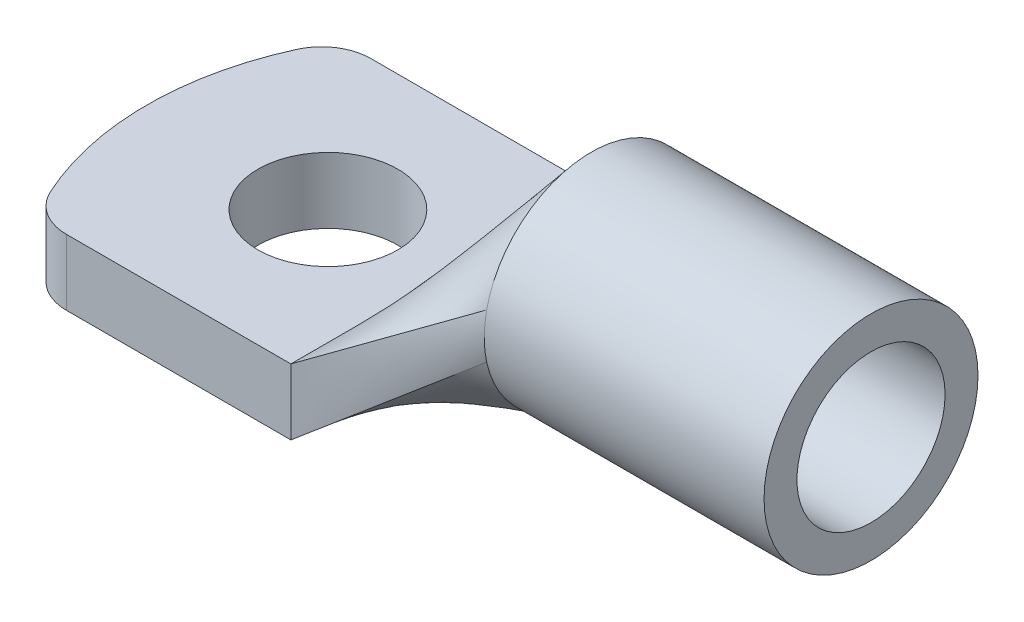
ISO-10303-21;
HEADER;
FILE_DESCRIPTION(('STEP AP214'),'2;1');
FILE_NAME('part.step','',(''),(''),'','','');
FILE_SCHEMA(('AUTOMOTIVE_DESIGN { 1 0 10303 214 1 1 1 1 }'));
ENDSEC;
DATA;
#1=APPLICATION_CONTEXT('core data for automotive mechanical design processes');
#2=APPLICATION_PROTOCOL_DEFINITION('international standard','automotive_design',2000,#1);
#3=PRODUCT_CONTEXT('',#1,'mechanical');
#4=PRODUCT('Part','Part','',(#3));
#5=PRODUCT_RELATED_PRODUCT_CATEGORY('part','',(#4));
#6=PRODUCT_DEFINITION_FORMATION('','',#4);
#7=PRODUCT_DEFINITION_CONTEXT('part definition',#1,'design');
#8=PRODUCT_DEFINITION('design','',#6,#7);
#9=PRODUCT_DEFINITION_SHAPE('','',#8);
#10=(LENGTH_UNIT() NAMED_UNIT(*) SI_UNIT(.MILLI.,.METRE.));
#11=(NAMED_UNIT(*) PLANE_ANGLE_UNIT() SI_UNIT($,.RADIAN.));
#12=(NAMED_UNIT(*) SI_UNIT($,.STERADIAN.) SOLID_ANGLE_UNIT());
#13=UNCERTAINTY_MEASURE_WITH_UNIT(LENGTH_MEASURE(1.E-05),#10,'distance_accuracy_value','');
#14=(GEOMETRIC_REPRESENTATION_CONTEXT(3) GLOBAL_UNCERTAINTY_ASSIGNED_CONTEXT((#13)) GLOBAL_UNIT_ASSIGNED_CONTEXT((#10,
#11,#12)) REPRESENTATION_CONTEXT('',''));
#15=CARTESIAN_POINT('',(0.,0.,0.));
#16=DIRECTION('',(0.,0.,1.));
#17=DIRECTION('',(1.,0.,0.));
#18=AXIS2_PLACEMENT_3D('',#15,#16,#17);
#19=CARTESIAN_POINT('',(0.,4.,-9.25));
#20=DIRECTION('',(0.,0.,-1.));
#21=DIRECTION('',(-1.,0.,0.));
#22=AXIS2_PLACEMENT_3D('',#19,#20,#21);
#23=PLANE('',#22);
#24=DIRECTION('',(1.,0.,0.));
#25=VECTOR('',#24,1.);
#26=CARTESIAN_POINT('',(0.,0.,-9.25));
#27=LINE('',#26,#25);
#28=CARTESIAN_POINT('',(-4.63589014329465,0.,-9.25));
#29=VERTEX_POINT('',#28);
#30=CARTESIAN_POINT('',(9.,0.,-9.25));
#31=VERTEX_POINT('',#30);
#32=EDGE_CURVE('E172',#29,#31,#27,.T.);
#33=ORIENTED_EDGE('',*,*,#32,.F.);
#34=DIRECTION('',(0.,1.,0.));
#35=VECTOR('',#34,1.);
#36=CARTESIAN_POINT('',(-4.63589014329465,4.,-9.25));
#37=LINE('',#36,#35);
#38=CARTESIAN_POINT('',(-4.63589014329465,4.,-9.25));
#39=VERTEX_POINT('',#38);
#40=EDGE_CURVE('E334',#29,#39,#37,.T.);
#41=ORIENTED_EDGE('',*,*,#40,.T.);
#42=DIRECTION('',(1.,0.,0.));
#43=VECTOR('',#42,1.);
#44=CARTESIAN_POINT('',(0.,4.,-9.25));
#45=LINE('',#44,#43);
#46=CARTESIAN_POINT('',(9.,4.,-9.25));
#47=VERTEX_POINT('',#46);
#48=EDGE_CURVE('E179',#39,#47,#45,.T.);
#49=ORIENTED_EDGE('',*,*,#48,.T.);
#50=DIRECTION('',(0.,1.,0.));
#51=VECTOR('',#50,1.);
#52=CARTESIAN_POINT('',(9.,4.,-9.25));
#53=LINE('',#52,#51);
#54=EDGE_CURVE('E185',#47,#31,#53,.F.);
#55=ORIENTED_EDGE('',*,*,#54,.T.);
#56=EDGE_LOOP('',(#33,#41,#49,#55));
#57=FACE_BOUND('',#56,.T.);
#58=ADVANCED_FACE('F74',(#57),#23,.T.);
#59=CARTESIAN_POINT('',(9.,4.,0.));
#60=DIRECTION('',(0.,-1.,0.));
#61=DIRECTION('',(0.,0.,-1.));
#62=AXIS2_PLACEMENT_3D('',#59,#60,#61);
#63=CYLINDRICAL_SURFACE('',#62,18.);
#64=CARTESIAN_POINT('',(9.,4.,0.));
#65=DIRECTION('',(0.,1.,0.));
#66=DIRECTION('',(0.,0.,1.));
#67=AXIS2_PLACEMENT_3D('',#64,#65,#66);
#68=CIRCLE('',#67,18.);
#69=CARTESIAN_POINT('',(-7.36306817195357,4.,-7.5));
#70=VERTEX_POINT('',#69);
#71=CARTESIAN_POINT('',(-7.36306817195357,4.,7.5));
#72=VERTEX_POINT('',#71);
#73=EDGE_CURVE('E178',#70,#72,#68,.T.);
#74=ORIENTED_EDGE('',*,*,#73,.F.);
#75=DIRECTION('',(0.,-1.,0.));
#76=VECTOR('',#75,1.);
#77=CARTESIAN_POINT('',(-7.36306817195358,4.,-7.5));
#78=LINE('',#77,#76);
#79=CARTESIAN_POINT('',(-7.36306817195357,0.,-7.5));
#80=VERTEX_POINT('',#79);
#81=EDGE_CURVE('E157',#70,#80,#78,.T.);
#82=ORIENTED_EDGE('',*,*,#81,.T.);
#83=CARTESIAN_POINT('',(9.,0.,0.));
#84=DIRECTION('',(0.,1.,0.));
#85=DIRECTION('',(0.,0.,1.));
#86=AXIS2_PLACEMENT_3D('',#83,#84,#85);
#87=CIRCLE('',#86,18.);
#88=CARTESIAN_POINT('',(-7.36306817195357,0.,7.5));
#89=VERTEX_POINT('',#88);
#90=EDGE_CURVE('E168',#80,#89,#87,.T.);
#91=ORIENTED_EDGE('',*,*,#90,.T.);
#92=DIRECTION('',(0.,-1.,0.));
#93=VECTOR('',#92,1.);
#94=CARTESIAN_POINT('',(-7.36306817195358,4.,7.5));
#95=LINE('',#94,#93);
#96=EDGE_CURVE('E153',#89,#72,#95,.F.);
#97=ORIENTED_EDGE('',*,*,#96,.T.);
#98=EDGE_LOOP('',(#74,#82,#91,#97));
#99=FACE_BOUND('',#98,.T.);
#100=ADVANCED_FACE('F343',(#99),#63,.T.);
#101=CARTESIAN_POINT('',(0.,4.,9.25));
#102=DIRECTION('',(0.,0.,-1.));
#103=DIRECTION('',(-1.,0.,0.));
#104=AXIS2_PLACEMENT_3D('',#101,#102,#103);
#105=PLANE('',#104);
#106=DIRECTION('',(1.,0.,0.));
#107=VECTOR('',#106,1.);
#108=CARTESIAN_POINT('',(0.,4.,9.25));
#109=LINE('',#108,#107);
#110=CARTESIAN_POINT('',(-4.63589014329465,4.,9.25));
#111=VERTEX_POINT('',#110);
#112=CARTESIAN_POINT('',(9.,4.,9.25));
#113=VERTEX_POINT('',#112);
#114=EDGE_CURVE('E164',#111,#113,#109,.T.);
#115=ORIENTED_EDGE('',*,*,#114,.F.);
#116=DIRECTION('',(0.,-1.,0.));
#117=VECTOR('',#116,1.);
#118=CARTESIAN_POINT('',(-4.63589014329465,4.,9.25));
#119=LINE('',#118,#117);
#120=CARTESIAN_POINT('',(-4.63589014329465,0.,9.25));
#121=VERTEX_POINT('',#120);
#122=EDGE_CURVE('E85',#111,#121,#119,.T.);
#123=ORIENTED_EDGE('',*,*,#122,.T.);
#124=DIRECTION('',(1.,0.,0.));
#125=VECTOR('',#124,1.);
#126=CARTESIAN_POINT('',(0.,0.,9.25));
#127=LINE('',#126,#125);
#128=CARTESIAN_POINT('',(9.,0.,9.25));
#129=VERTEX_POINT('',#128);
#130=EDGE_CURVE('E162',#121,#129,#127,.T.);
#131=ORIENTED_EDGE('',*,*,#130,.T.);
#132=DIRECTION('',(0.,1.,0.));
#133=VECTOR('',#132,1.);
#134=CARTESIAN_POINT('',(9.,4.,9.25));
#135=LINE('',#134,#133);
#136=EDGE_CURVE('E183',#113,#129,#135,.F.);
#137=ORIENTED_EDGE('',*,*,#136,.F.);
#138=EDGE_LOOP('',(#115,#123,#131,#137));
#139=FACE_BOUND('',#138,.T.);
#140=ADVANCED_FACE('F160',(#139),#105,.F.);
#141=CARTESIAN_POINT('',(2.,4.,0.));
#142=DIRECTION('',(0.,-1.,0.));
#143=DIRECTION('',(0.,0.,-1.));
#144=AXIS2_PLACEMENT_3D('',#141,#142,#143);
#145=CYLINDRICAL_SURFACE('',#144,4.25);
#146=CARTESIAN_POINT('',(2.,4.,0.));
#147=DIRECTION('',(0.,1.,0.));
#148=DIRECTION('',(0.,0.,1.));
#149=AXIS2_PLACEMENT_3D('',#146,#147,#148);
#150=CIRCLE('',#149,4.25);
#151=CARTESIAN_POINT('',(2.,4.,4.25000000000001));
#152=VERTEX_POINT('',#151);
#153=EDGE_CURVE('E170',#152,#152,#150,.T.);
#154=ORIENTED_EDGE('',*,*,#153,.T.);
#155=EDGE_LOOP('',(#154));
#156=FACE_BOUND('',#155,.T.);
#157=CARTESIAN_POINT('',(2.,0.,0.));
#158=DIRECTION('',(0.,1.,0.));
#159=DIRECTION('',(0.,0.,1.));
#160=AXIS2_PLACEMENT_3D('',#157,#158,#159);
#161=CIRCLE('',#160,4.25);
#162=CARTESIAN_POINT('',(2.,0.,4.25000000000001));
#163=VERTEX_POINT('',#162);
#164=EDGE_CURVE('E182',#163,#163,#161,.T.);
#165=ORIENTED_EDGE('',*,*,#164,.F.);
#166=EDGE_LOOP('',(#165));
#167=FACE_BOUND('',#166,.T.);
#168=ADVANCED_FACE('F362',(#156,#167),#145,.F.);
#169=CARTESIAN_POINT('',(0.,4.,0.));
#170=DIRECTION('',(0.,1.,0.));
#171=DIRECTION('',(0.,0.,1.));
#172=AXIS2_PLACEMENT_3D('',#169,#170,#171);
#173=PLANE('',#172);
#174=ORIENTED_EDGE('',*,*,#153,.F.);
#175=EDGE_LOOP('',(#174));
#176=FACE_BOUND('',#175,.T.);
#177=ORIENTED_EDGE('',*,*,#48,.F.);
#178=CARTESIAN_POINT('',(-4.63589014329465,4.,-6.25));
#179=DIRECTION('',(0.,1.,0.));
#180=DIRECTION('',(0.,0.,1.));
#181=AXIS2_PLACEMENT_3D('',#178,#179,#180);
#182=CIRCLE('',#181,3.);
#183=EDGE_CURVE('E165',#39,#70,#182,.T.);
#184=ORIENTED_EDGE('',*,*,#183,.T.);
#185=ORIENTED_EDGE('',*,*,#73,.T.);
#186=CARTESIAN_POINT('',(-4.63589014329465,4.,6.25));
#187=DIRECTION('',(0.,1.,0.));
#188=DIRECTION('',(0.,0.,1.));
#189=AXIS2_PLACEMENT_3D('',#186,#187,#188);
#190=CIRCLE('',#189,3.);
#191=EDGE_CURVE('E94',#72,#111,#190,.T.);
#192=ORIENTED_EDGE('',*,*,#191,.T.);
#193=ORIENTED_EDGE('',*,*,#114,.T.);
#194=DIRECTION('',(0.,0.,1.));
#195=VECTOR('',#194,1.);
#196=CARTESIAN_POINT('',(9.,4.,0.));
#197=LINE('',#196,#195);
#198=EDGE_CURVE('E177',#113,#47,#197,.F.);
#199=ORIENTED_EDGE('',*,*,#198,.T.);
#200=EDGE_LOOP('',(#177,#184,#185,#192,#193,#199));
#201=FACE_BOUND('',#200,.T.);
#202=ADVANCED_FACE('F329',(#176,#201),#173,.T.);
#203=CARTESIAN_POINT('',(0.,0.,0.));
#204=DIRECTION('',(0.,1.,0.));
#205=DIRECTION('',(0.,0.,1.));
#206=AXIS2_PLACEMENT_3D('',#203,#204,#205);
#207=PLANE('',#206);
#208=ORIENTED_EDGE('',*,*,#164,.T.);
#209=EDGE_LOOP('',(#208));
#210=FACE_BOUND('',#209,.T.);
#211=ORIENTED_EDGE('',*,*,#90,.F.);
#212=CARTESIAN_POINT('',(-4.63589014329465,0.,-6.25));
#213=DIRECTION('',(0.,1.,0.));
#214=DIRECTION('',(0.,0.,1.));
#215=AXIS2_PLACEMENT_3D('',#212,#213,#214);
#216=CIRCLE('',#215,3.);
#217=EDGE_CURVE('E156',#80,#29,#216,.F.);
#218=ORIENTED_EDGE('',*,*,#217,.T.);
#219=ORIENTED_EDGE('',*,*,#32,.T.);
#220=DIRECTION('',(0.,0.,1.));
#221=VECTOR('',#220,1.);
#222=CARTESIAN_POINT('',(9.,0.,0.));
#223=LINE('',#222,#221);
#224=EDGE_CURVE('E114',#129,#31,#223,.F.);
#225=ORIENTED_EDGE('',*,*,#224,.F.);
#226=ORIENTED_EDGE('',*,*,#130,.F.);
#227=CARTESIAN_POINT('',(-4.63589014329465,0.,6.25));
#228=DIRECTION('',(0.,1.,0.));
#229=DIRECTION('',(0.,0.,1.));
#230=AXIS2_PLACEMENT_3D('',#227,#228,#229);
#231=CIRCLE('',#230,3.);
#232=EDGE_CURVE('E151',#121,#89,#231,.F.);
#233=ORIENTED_EDGE('',*,*,#232,.T.);
#234=EDGE_LOOP('',(#211,#218,#219,#225,#226,#233));
#235=FACE_BOUND('',#234,.T.);
#236=ADVANCED_FACE('F167',(#210,#235),#207,.F.);
#237=CARTESIAN_POINT('',(-4.63589014329465,4.,-6.25));
#238=DIRECTION('',(0.,-1.,0.));
#239=DIRECTION('',(0.,0.,-1.));
#240=AXIS2_PLACEMENT_3D('',#237,#238,#239);
#241=CYLINDRICAL_SURFACE('',#240,3.);
#242=ORIENTED_EDGE('',*,*,#183,.F.);
#243=ORIENTED_EDGE('',*,*,#40,.F.);
#244=ORIENTED_EDGE('',*,*,#217,.F.);
#245=ORIENTED_EDGE('',*,*,#81,.F.);
#246=EDGE_LOOP('',(#242,#243,#244,#245));
#247=FACE_BOUND('',#246,.T.);
#248=ADVANCED_FACE('F344',(#247),#241,.T.);
#249=CARTESIAN_POINT('',(-4.63589014329465,4.,6.25));
#250=DIRECTION('',(0.,-1.,0.));
#251=DIRECTION('',(0.,0.,-1.));
#252=AXIS2_PLACEMENT_3D('',#249,#250,#251);
#253=CYLINDRICAL_SURFACE('',#252,3.);
#254=ORIENTED_EDGE('',*,*,#191,.F.);
#255=ORIENTED_EDGE('',*,*,#96,.F.);
#256=ORIENTED_EDGE('',*,*,#232,.F.);
#257=ORIENTED_EDGE('',*,*,#122,.F.);
#258=EDGE_LOOP('',(#254,#255,#256,#257));
#259=FACE_BOUND('',#258,.T.);
#260=ADVANCED_FACE('F76',(#259),#253,.T.);
#261=CARTESIAN_POINT('',(9.,0.,-9.25));
#262=CARTESIAN_POINT('',(18.,7.145621458571,-6.35319207535914));
#263=CARTESIAN_POINT('',(9.,0.666666666666667,-9.25));
#264=CARTESIAN_POINT('',(18.,7.59316739948749,-6.44995876528703));
#265=CARTESIAN_POINT('',(9.,1.33333333333333,-9.25));
#266=CARTESIAN_POINT('',(18.,8.05616694335666,-6.5));
#267=CARTESIAN_POINT('',(9.,2.66666666666667,-9.25));
#268=CARTESIAN_POINT('',(18.,8.98240227664334,-6.5));
#269=CARTESIAN_POINT('',(9.,3.33333333333333,-9.25));
#270=CARTESIAN_POINT('',(18.,9.44540182051252,-6.44995876528703));
#271=CARTESIAN_POINT('',(9.,4.,-9.25));
#272=CARTESIAN_POINT('',(18.,9.89294776142901,-6.35319207535914));
#273=B_SPLINE_SURFACE_WITH_KNOTS('',3,1,((#261,#262),(#263,#264),(#265,#266),(#267,#268),(#269,
#270),(#271,#272)),.UNSPECIFIED.,.F.,.F.,.F.,(4,2,4),(2,2),(0.,0.5,1.),(0.,1.),.UNSPECIFIED.);
#274=DIRECTION('',(0.807838503036537,0.528950010896146,0.260016997491805));
#275=VECTOR('',#274,1.);
#276=CARTESIAN_POINT('',(13.5,6.9464738807145,-7.80159603767957));
#277=LINE('',#276,#275);
#278=CARTESIAN_POINT('',(18.,9.89307986731626,-6.35380128540032));
#279=VERTEX_POINT('',#278);
#280=EDGE_CURVE('E316',#47,#279,#277,.T.);
#281=CARTESIAN_POINT('',(18.,8.51928461,0.));
#282=DIRECTION('',(1.,0.,0.));
#283=DIRECTION('',(0.,0.,-1.));
#284=AXIS2_PLACEMENT_3D('',#281,#282,#283);
#285=CIRCLE('',#284,6.5);
#286=CARTESIAN_POINT('',(18.,7.14549797734405,-6.35376124732742));
#287=VERTEX_POINT('',#286);
#288=EDGE_CURVE('E78',#287,#279,#285,.T.);
#289=DIRECTION('',(-0.759415522313199,-0.602943983579233,-0.244431211459128));
#290=VECTOR('',#289,1.);
#291=CARTESIAN_POINT('',(13.5,3.5728107292855,-7.80159603767957));
#292=LINE('',#291,#290);
#293=EDGE_CURVE('E313',#287,#31,#292,.T.);
#294=ORIENTED_EDGE('',*,*,#54,.F.);
#295=ORIENTED_EDGE('',*,*,#280,.T.);
#296=ORIENTED_EDGE('',*,*,#288,.F.);
#297=ORIENTED_EDGE('',*,*,#293,.T.);
#298=EDGE_LOOP('',(#294,#295,#296,#297));
#299=FACE_BOUND('',#298,.T.);
#300=ADVANCED_FACE('F242',(#299),#273,.T.);
#301=CARTESIAN_POINT('',(9.,4.,-9.25));
#302=CARTESIAN_POINT('',(18.,9.892947761429,-6.35319207535914));
#303=CARTESIAN_POINT('',(9.,4.,-8.47916666666666));
#304=CARTESIAN_POINT('',(18.,10.4104227556137,-6.24130559013001));
#305=CARTESIAN_POINT('',(9.,4.,-7.70833333333333));
#306=CARTESIAN_POINT('',(18.,10.9677174700676,-6.05512497589111));
#307=CARTESIAN_POINT('',(9.,4.,-6.16666666666666));
#308=CARTESIAN_POINT('',(18.,12.1013351609206,-5.46152687392169));
#309=CARTESIAN_POINT('',(9.,4.,-5.39583333333333));
#310=CARTESIAN_POINT('',(18.,12.6778161259908,-5.05190768004299));
#311=CARTESIAN_POINT('',(9.,4.,-4.23958333333333));
#312=CARTESIAN_POINT('',(18.,13.4603392328366,-4.23996086166335));
#313=CARTESIAN_POINT('',(9.,4.,-3.85416666666666));
#314=CARTESIAN_POINT('',(18.,13.7068864246582,-3.93689122231742));
#315=CARTESIAN_POINT('',(9.,4.,-3.08333333333333));
#316=CARTESIAN_POINT('',(18.,14.1508635798117,-3.27041945177983));
#317=CARTESIAN_POINT('',(9.,4.,-2.69791666666666));
#318=CARTESIAN_POINT('',(18.,14.3481588267121,-2.90699254098453));
#319=CARTESIAN_POINT('',(9.,4.,-1.92708333333332));
#320=CARTESIAN_POINT('',(18.,14.6737839361115,-2.13272555957954));
#321=CARTESIAN_POINT('',(9.,4.,-1.54166666666666));
#322=CARTESIAN_POINT('',(18.,14.8019676129627,-1.72194455615372));
#323=CARTESIAN_POINT('',(9.,4.,-0.770833333333324));
#324=CARTESIAN_POINT('',(18.,14.9747664777475,-0.874043834923259));
#325=CARTESIAN_POINT('',(9.,4.,-0.385416666666657));
#326=CARTESIAN_POINT('',(18.,15.01928461,-0.437066243242613));
#327=CARTESIAN_POINT('',(9.,4.,0.385416666666677));
#328=CARTESIAN_POINT('',(18.,15.01928461,0.437066243242612));
#329=CARTESIAN_POINT('',(9.,4.,0.770833333333344));
#330=CARTESIAN_POINT('',(18.,14.9747664777474,0.87404383492326));
#331=CARTESIAN_POINT('',(9.,4.,1.54166666666668));
#332=CARTESIAN_POINT('',(18.,14.8019676129627,1.72194455615372));
#333=CARTESIAN_POINT('',(9.,4.,1.92708333333334));
#334=CARTESIAN_POINT('',(18.,14.6737839361115,2.13272555957954));
#335=CARTESIAN_POINT('',(9.,4.,2.69791666666668));
#336=CARTESIAN_POINT('',(18.,14.3481588267121,2.90699254098453));
#337=CARTESIAN_POINT('',(9.,4.,3.08333333333334));
#338=CARTESIAN_POINT('',(18.,14.1508635798117,3.27041945177983));
#339=CARTESIAN_POINT('',(9.,4.,3.85416666666668));
#340=CARTESIAN_POINT('',(18.,13.7068864246582,3.93689122231742));
#341=CARTESIAN_POINT('',(9.,4.,4.23958333333334));
#342=CARTESIAN_POINT('',(18.,13.4603392328366,4.23996086166335));
#343=CARTESIAN_POINT('',(9.,4.,5.39583333333334));
#344=CARTESIAN_POINT('',(18.,12.6778161259908,5.05190768004299));
#345=CARTESIAN_POINT('',(9.,4.,6.16666666666667));
#346=CARTESIAN_POINT('',(18.,12.1013351609206,5.46152687392169));
#347=CARTESIAN_POINT('',(9.,4.,7.70833333333334));
#348=CARTESIAN_POINT('',(18.,10.9677174700676,6.05512497589111));
#349=CARTESIAN_POINT('',(9.,4.,8.47916666666667));
#350=CARTESIAN_POINT('',(18.,10.4104227556137,6.24130559013002));
#351=CARTESIAN_POINT('',(9.,4.,9.25));
#352=CARTESIAN_POINT('',(18.,9.892947761429,6.35319207535914));
#353=B_SPLINE_SURFACE_WITH_KNOTS('',3,1,((#301,#302),(#303,#304),(#305,#306),(#307,#308),(#309,
#310),(#311,#312),(#313,#314),(#315,#316),(#317,#318),(#319,#320),(#321,#322),(#323,#324),(#325,
#326),(#327,#328),(#329,#330),(#331,#332),(#333,#334),(#335,#336),(#337,#338),(#339,#340),(#341,
#342),(#343,#344),(#345,#346),(#347,#348),(#349,#350),(#351,#352)),.UNSPECIFIED.,.F.,.F.,.F.,(4,
2,2,2,2,2,2,2,2,2,2,2,4),(2,2),(0.,0.125,0.25,0.3125,0.375,0.4375,0.5,0.5625,0.625,0.6875,0.75,
0.875,1.),(0.,1.),.UNSPECIFIED.);
#354=DIRECTION('',(0.807838503036537,0.528950010896146,-0.260016997491806));
#355=VECTOR('',#354,1.);
#356=CARTESIAN_POINT('',(13.5,6.9464738807145,7.80159603767957));
#357=LINE('',#356,#355);
#358=CARTESIAN_POINT('',(18.,9.89307493984266,6.35377809382672));
#359=VERTEX_POINT('',#358);
#360=EDGE_CURVE('E320',#113,#359,#357,.T.);
#361=EDGE_CURVE('E193',#279,#359,#285,.T.);
#362=ORIENTED_EDGE('',*,*,#198,.F.);
#363=ORIENTED_EDGE('',*,*,#360,.T.);
#364=ORIENTED_EDGE('',*,*,#361,.F.);
#365=ORIENTED_EDGE('',*,*,#280,.F.);
#366=EDGE_LOOP('',(#362,#363,#364,#365));
#367=FACE_BOUND('',#366,.T.);
#368=ADVANCED_FACE('F247',(#367),#353,.T.);
#369=CARTESIAN_POINT('',(9.,0.,9.25));
#370=CARTESIAN_POINT('',(18.,7.145621458571,6.35319207535914));
#371=CARTESIAN_POINT('',(9.,0.,8.47916666666667));
#372=CARTESIAN_POINT('',(18.,6.62814646438631,6.24130559013002));
#373=CARTESIAN_POINT('',(9.,0.,7.70833333333334));
#374=CARTESIAN_POINT('',(18.,6.0708517499324,6.05512497589111));
#375=CARTESIAN_POINT('',(9.,0.,6.16666666666667));
#376=CARTESIAN_POINT('',(18.,4.93723405907944,5.46152687392169));
#377=CARTESIAN_POINT('',(9.,0.,5.39583333333334));
#378=CARTESIAN_POINT('',(18.,4.36075309400917,5.051907680043));
#379=CARTESIAN_POINT('',(9.,0.,4.23958333333334));
#380=CARTESIAN_POINT('',(18.,3.57822998716344,4.23996086166336));
#381=CARTESIAN_POINT('',(9.,0.,3.85416666666667));
#382=CARTESIAN_POINT('',(18.,3.33168279534176,3.93689122231742));
#383=CARTESIAN_POINT('',(9.,0.,3.08333333333334));
#384=CARTESIAN_POINT('',(18.,2.88770564018829,3.27041945177983));
#385=CARTESIAN_POINT('',(9.,0.,2.69791666666668));
#386=CARTESIAN_POINT('',(18.,2.69041039328786,2.90699254098454));
#387=CARTESIAN_POINT('',(9.,0.,1.92708333333334));
#388=CARTESIAN_POINT('',(18.,2.36478528388845,2.13272555957955));
#389=CARTESIAN_POINT('',(9.,0.,1.54166666666668));
#390=CARTESIAN_POINT('',(18.,2.23660160703733,1.72194455615373));
#391=CARTESIAN_POINT('',(9.,0.,0.770833333333344));
#392=CARTESIAN_POINT('',(18.,2.06380274225255,0.874043834923261));
#393=CARTESIAN_POINT('',(9.,0.,0.385416666666677));
#394=CARTESIAN_POINT('',(18.,2.01928461,0.437066243242615));
#395=CARTESIAN_POINT('',(9.,0.,-0.385416666666656));
#396=CARTESIAN_POINT('',(18.,2.01928461,-0.437066243242611));
#397=CARTESIAN_POINT('',(9.,0.,-0.770833333333321));
#398=CARTESIAN_POINT('',(18.,2.06380274225255,-0.874043834923258));
#399=CARTESIAN_POINT('',(9.,0.,-1.54166666666665));
#400=CARTESIAN_POINT('',(18.,2.23660160703733,-1.72194455615372));
#401=CARTESIAN_POINT('',(9.,0.,-1.92708333333332));
#402=CARTESIAN_POINT('',(18.,2.36478528388845,-2.13272555957954));
#403=CARTESIAN_POINT('',(9.,0.,-2.69791666666665));
#404=CARTESIAN_POINT('',(18.,2.69041039328785,-2.90699254098453));
#405=CARTESIAN_POINT('',(9.,0.,-3.08333333333332));
#406=CARTESIAN_POINT('',(18.,2.88770564018829,-3.27041945177983));
#407=CARTESIAN_POINT('',(9.,0.,-3.85416666666665));
#408=CARTESIAN_POINT('',(18.,3.33168279534176,-3.93689122231742));
#409=CARTESIAN_POINT('',(9.,0.,-4.23958333333332));
#410=CARTESIAN_POINT('',(18.,3.57822998716344,-4.23996086166336));
#411=CARTESIAN_POINT('',(9.,0.,-5.39583333333332));
#412=CARTESIAN_POINT('',(18.,4.36075309400917,-5.05190768004299));
#413=CARTESIAN_POINT('',(9.,0.,-6.16666666666666));
#414=CARTESIAN_POINT('',(18.,4.93723405907943,-5.46152687392169));
#415=CARTESIAN_POINT('',(9.,0.,-7.70833333333333));
#416=CARTESIAN_POINT('',(18.,6.0708517499324,-6.05512497589111));
#417=CARTESIAN_POINT('',(9.,0.,-8.47916666666666));
#418=CARTESIAN_POINT('',(18.,6.6281464643863,-6.24130559013002));
#419=CARTESIAN_POINT('',(9.,0.,-9.25));
#420=CARTESIAN_POINT('',(18.,7.145621458571,-6.35319207535914));
#421=B_SPLINE_SURFACE_WITH_KNOTS('',3,1,((#369,#370),(#371,#372),(#373,#374),(#375,#376),(#377,
#378),(#379,#380),(#381,#382),(#383,#384),(#385,#386),(#387,#388),(#389,#390),(#391,#392),(#393,
#394),(#395,#396),(#397,#398),(#399,#400),(#401,#402),(#403,#404),(#405,#406),(#407,#408),(#409,
#410),(#411,#412),(#413,#414),(#415,#416),(#417,#418),(#419,#420)),.UNSPECIFIED.,.F.,.F.,.F.,(4,
2,2,2,2,2,2,2,2,2,2,2,4),(2,2),(0.,0.125,0.25,0.3125,0.375,0.4375,0.5,0.5625,0.625,0.6875,0.75,
0.875,1.),(0.,1.),.UNSPECIFIED.);
#422=CARTESIAN_POINT('',(18.,7.1454930575139,6.35378439801342));
#423=VERTEX_POINT('',#422);
#424=EDGE_CURVE('E125',#423,#287,#285,.T.);
#425=DIRECTION('',(0.759415522313199,0.602943983579233,-0.244431211459128));
#426=VECTOR('',#425,1.);
#427=CARTESIAN_POINT('',(13.5,3.5728107292855,7.80159603767957));
#428=LINE('',#427,#426);
#429=EDGE_CURVE('E194',#129,#423,#428,.T.);
#430=ORIENTED_EDGE('',*,*,#224,.T.);
#431=ORIENTED_EDGE('',*,*,#293,.F.);
#432=ORIENTED_EDGE('',*,*,#424,.F.);
#433=ORIENTED_EDGE('',*,*,#429,.F.);
#434=EDGE_LOOP('',(#430,#431,#432,#433));
#435=FACE_BOUND('',#434,.T.);
#436=ADVANCED_FACE('F271',(#435),#421,.T.);
#437=CARTESIAN_POINT('',(9.,4.,9.25));
#438=CARTESIAN_POINT('',(18.,9.892947761429,6.35319207535914));
#439=CARTESIAN_POINT('',(9.,3.33333333333333,9.25));
#440=CARTESIAN_POINT('',(18.,9.44540182051251,6.44995876528703));
#441=CARTESIAN_POINT('',(9.,2.66666666666666,9.25));
#442=CARTESIAN_POINT('',(18.,8.98240227664334,6.5));
#443=CARTESIAN_POINT('',(9.,1.33333333333333,9.25));
#444=CARTESIAN_POINT('',(18.,8.05616694335666,6.5));
#445=CARTESIAN_POINT('',(9.,0.666666666666664,9.25));
#446=CARTESIAN_POINT('',(18.,7.59316739948749,6.44995876528703));
#447=CARTESIAN_POINT('',(9.,0.,9.25));
#448=CARTESIAN_POINT('',(18.,7.145621458571,6.35319207535914));
#449=B_SPLINE_SURFACE_WITH_KNOTS('',3,1,((#437,#438),(#439,#440),(#441,#442),(#443,#444),(#445,
#446),(#447,#448)),.UNSPECIFIED.,.F.,.F.,.F.,(4,2,4),(2,2),(0.,0.5,1.),(0.,1.),.UNSPECIFIED.);
#450=EDGE_CURVE('E190',#359,#423,#285,.T.);
#451=ORIENTED_EDGE('',*,*,#136,.T.);
#452=ORIENTED_EDGE('',*,*,#429,.T.);
#453=ORIENTED_EDGE('',*,*,#450,.F.);
#454=ORIENTED_EDGE('',*,*,#360,.F.);
#455=EDGE_LOOP('',(#451,#452,#453,#454));
#456=FACE_BOUND('',#455,.T.);
#457=ADVANCED_FACE('F282',(#456),#449,.T.);
#458=CARTESIAN_POINT('',(35.,8.51928461,0.));
#459=DIRECTION('',(1.,0.,0.));
#460=DIRECTION('',(0.,0.,-1.));
#461=AXIS2_PLACEMENT_3D('',#458,#459,#460);
#462=PLANE('',#461);
#463=CARTESIAN_POINT('',(35.,8.51928461,0.));
#464=DIRECTION('',(1.,0.,0.));
#465=DIRECTION('',(0.,0.,-1.));
#466=AXIS2_PLACEMENT_3D('',#463,#464,#465);
#467=CIRCLE('',#466,6.5);
#468=CARTESIAN_POINT('',(35.,8.51928461,-6.5));
#469=VERTEX_POINT('',#468);
#470=EDGE_CURVE('E222',#469,#469,#467,.T.);
#471=ORIENTED_EDGE('',*,*,#470,.T.);
#472=EDGE_LOOP('',(#471));
#473=FACE_BOUND('',#472,.T.);
#474=CARTESIAN_POINT('',(35.,8.51928461,0.));
#475=DIRECTION('',(1.,0.,0.));
#476=DIRECTION('',(0.,0.,-1.));
#477=AXIS2_PLACEMENT_3D('',#474,#475,#476);
#478=CIRCLE('',#477,4.5);
#479=CARTESIAN_POINT('',(35.,8.51928461,-4.5));
#480=VERTEX_POINT('',#479);
#481=EDGE_CURVE('E465',#480,#480,#478,.T.);
#482=ORIENTED_EDGE('',*,*,#481,.F.);
#483=EDGE_LOOP('',(#482));
#484=FACE_BOUND('',#483,.T.);
#485=ADVANCED_FACE('F239',(#473,#484),#462,.T.);
#486=CARTESIAN_POINT('',(35.,8.51928461,0.));
#487=DIRECTION('',(-1.,0.,0.));
#488=DIRECTION('',(0.,0.,1.));
#489=AXIS2_PLACEMENT_3D('',#486,#487,#488);
#490=CYLINDRICAL_SURFACE('',#489,6.5);
#491=ORIENTED_EDGE('',*,*,#470,.F.);
#492=EDGE_LOOP('',(#491));
#493=FACE_BOUND('',#492,.T.);
#494=ORIENTED_EDGE('',*,*,#361,.T.);
#495=ORIENTED_EDGE('',*,*,#450,.T.);
#496=ORIENTED_EDGE('',*,*,#424,.T.);
#497=ORIENTED_EDGE('',*,*,#288,.T.);
#498=EDGE_LOOP('',(#494,#495,#496,#497));
#499=FACE_BOUND('',#498,.T.);
#500=ADVANCED_FACE('F214',(#493,#499),#490,.T.);
#501=CARTESIAN_POINT('',(35.,8.51928461,0.));
#502=DIRECTION('',(-1.,0.,0.));
#503=DIRECTION('',(0.,0.,1.));
#504=AXIS2_PLACEMENT_3D('',#501,#502,#503);
#505=CYLINDRICAL_SURFACE('',#504,4.5);
#506=ORIENTED_EDGE('',*,*,#481,.T.);
#507=EDGE_LOOP('',(#506));
#508=FACE_BOUND('',#507,.T.);
#509=CARTESIAN_POINT('',(18.,8.51928461,0.));
#510=DIRECTION('',(1.,0.,0.));
#511=DIRECTION('',(0.,0.,-1.));
#512=AXIS2_PLACEMENT_3D('',#509,#510,#511);
#513=CIRCLE('',#512,4.5);
#514=CARTESIAN_POINT('',(18.,8.51928461,-4.5));
#515=VERTEX_POINT('',#514);
#516=EDGE_CURVE('E12',#515,#515,#513,.F.);
#517=ORIENTED_EDGE('',*,*,#516,.T.);
#518=EDGE_LOOP('',(#517));
#519=FACE_BOUND('',#518,.T.);
#520=ADVANCED_FACE('F238',(#508,#519),#505,.F.);
#521=CARTESIAN_POINT('',(18.,8.51928461,0.));
#522=DIRECTION('',(1.,0.,0.));
#523=DIRECTION('',(0.,0.,-1.));
#524=AXIS2_PLACEMENT_3D('',#521,#522,#523);
#525=PLANE('',#524);
#526=ORIENTED_EDGE('',*,*,#516,.F.);
#527=EDGE_LOOP('',(#526));
#528=FACE_BOUND('',#527,.T.);
#529=ADVANCED_FACE('F294',(#528),#525,.T.);
#530=CLOSED_SHELL('',(#58,#100,#140,#168,#202,#236,#248,#260,#300,#368,#436,#457,#485,#500,#520,#529));
#531=MANIFOLD_SOLID_BREP('B2',#530);
#532=ADVANCED_BREP_SHAPE_REPRESENTATION('',(#18,#531),#14);
#533=SHAPE_DEFINITION_REPRESENTATION(#9,#532);
ENDSEC;
END-ISO-10303-21;
